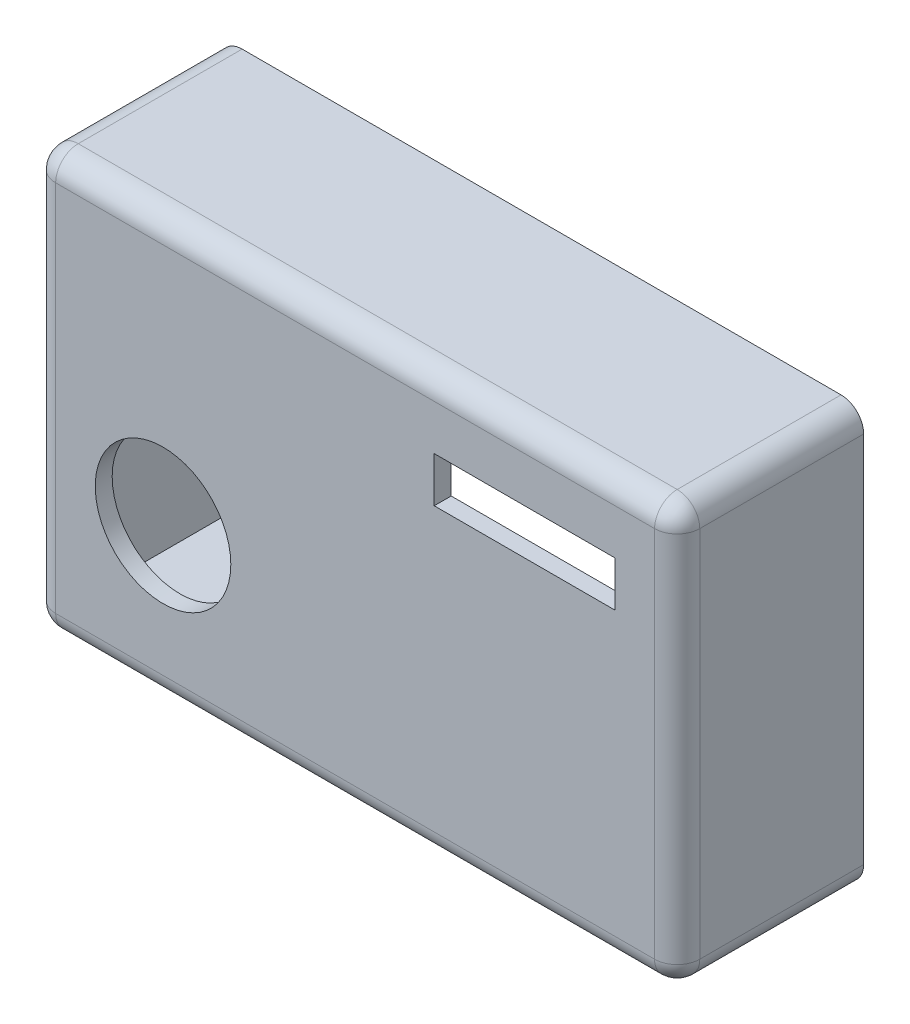
ISO-10303-21;
HEADER;
FILE_DESCRIPTION(('STEP AP214'),'2;1');
FILE_NAME('part.step','',(''),(''),'','','');
FILE_SCHEMA(('AUTOMOTIVE_DESIGN { 1 0 10303 214 1 1 1 1 }'));
ENDSEC;
DATA;
#1=APPLICATION_CONTEXT('core data for automotive mechanical design processes');
#2=APPLICATION_PROTOCOL_DEFINITION('international standard','automotive_design',2000,#1);
#3=PRODUCT_CONTEXT('',#1,'mechanical');
#4=PRODUCT('Part','Part','',(#3));
#5=PRODUCT_RELATED_PRODUCT_CATEGORY('part','',(#4));
#6=PRODUCT_DEFINITION_FORMATION('','',#4);
#7=PRODUCT_DEFINITION_CONTEXT('part definition',#1,'design');
#8=PRODUCT_DEFINITION('design','',#6,#7);
#9=PRODUCT_DEFINITION_SHAPE('','',#8);
#10=(LENGTH_UNIT() NAMED_UNIT(*) SI_UNIT(.MILLI.,.METRE.));
#11=(NAMED_UNIT(*) PLANE_ANGLE_UNIT() SI_UNIT($,.RADIAN.));
#12=(NAMED_UNIT(*) SI_UNIT($,.STERADIAN.) SOLID_ANGLE_UNIT());
#13=UNCERTAINTY_MEASURE_WITH_UNIT(LENGTH_MEASURE(1.E-05),#10,'distance_accuracy_value','');
#14=(GEOMETRIC_REPRESENTATION_CONTEXT(3) GLOBAL_UNCERTAINTY_ASSIGNED_CONTEXT((#13)) GLOBAL_UNIT_ASSIGNED_CONTEXT((#10,
#11,#12)) REPRESENTATION_CONTEXT('',''));
#15=CARTESIAN_POINT('',(0.,0.,0.));
#16=DIRECTION('',(0.,0.,1.));
#17=DIRECTION('',(1.,0.,0.));
#18=AXIS2_PLACEMENT_3D('',#15,#16,#17);
#19=CARTESIAN_POINT('',(0.,0.,1.5));
#20=DIRECTION('',(0.,0.,-1.));
#21=DIRECTION('',(-1.,0.,0.));
#22=AXIS2_PLACEMENT_3D('',#19,#20,#21);
#23=PLANE('',#22);
#24=DIRECTION('',(1.,0.,0.));
#25=VECTOR('',#24,1.);
#26=CARTESIAN_POINT('',(-28.5,16.5,1.5));
#27=LINE('',#26,#25);
#28=CARTESIAN_POINT('',(26.5,16.5,1.5));
#29=VERTEX_POINT('',#28);
#30=CARTESIAN_POINT('',(-26.5,16.5,1.5));
#31=VERTEX_POINT('',#30);
#32=EDGE_CURVE('E257',#29,#31,#27,.F.);
#33=ORIENTED_EDGE('',*,*,#32,.T.);
#34=DIRECTION('',(0.,1.,0.));
#35=VECTOR('',#34,1.);
#36=CARTESIAN_POINT('',(-26.5,-18.5,1.5));
#37=LINE('',#36,#35);
#38=CARTESIAN_POINT('',(-26.5,-16.5,1.5));
#39=VERTEX_POINT('',#38);
#40=EDGE_CURVE('E261',#31,#39,#37,.F.);
#41=ORIENTED_EDGE('',*,*,#40,.T.);
#42=DIRECTION('',(-1.,0.,0.));
#43=VECTOR('',#42,1.);
#44=CARTESIAN_POINT('',(28.5,-16.5,1.5));
#45=LINE('',#44,#43);
#46=CARTESIAN_POINT('',(26.5,-16.5,1.5));
#47=VERTEX_POINT('',#46);
#48=EDGE_CURVE('E259',#39,#47,#45,.F.);
#49=ORIENTED_EDGE('',*,*,#48,.T.);
#50=DIRECTION('',(0.,-1.,0.));
#51=VECTOR('',#50,1.);
#52=CARTESIAN_POINT('',(26.5,18.5,1.5));
#53=LINE('',#52,#51);
#54=EDGE_CURVE('E255',#47,#29,#53,.F.);
#55=ORIENTED_EDGE('',*,*,#54,.T.);
#56=EDGE_LOOP('',(#33,#41,#49,#55));
#57=FACE_BOUND('',#56,.T.);
#58=DIRECTION('',(-1.,0.,0.));
#59=VECTOR('',#58,1.);
#60=CARTESIAN_POINT('',(23.,12.5,1.5));
#61=LINE('',#60,#59);
#62=CARTESIAN_POINT('',(23.,12.5,1.5));
#63=VERTEX_POINT('',#62);
#64=CARTESIAN_POINT('',(7.,12.5,1.5));
#65=VERTEX_POINT('',#64);
#66=EDGE_CURVE('E207',#63,#65,#61,.T.);
#67=ORIENTED_EDGE('',*,*,#66,.F.);
#68=DIRECTION('',(0.,1.,0.));
#69=VECTOR('',#68,1.);
#70=CARTESIAN_POINT('',(23.,12.5,1.5));
#71=LINE('',#70,#69);
#72=CARTESIAN_POINT('',(23.,8.5,1.5));
#73=VERTEX_POINT('',#72);
#74=EDGE_CURVE('E205',#73,#63,#71,.T.);
#75=ORIENTED_EDGE('',*,*,#74,.F.);
#76=DIRECTION('',(1.,0.,0.));
#77=VECTOR('',#76,1.);
#78=CARTESIAN_POINT('',(23.,8.5,1.5));
#79=LINE('',#78,#77);
#80=CARTESIAN_POINT('',(7.,8.5,1.5));
#81=VERTEX_POINT('',#80);
#82=EDGE_CURVE('E213',#81,#73,#79,.T.);
#83=ORIENTED_EDGE('',*,*,#82,.F.);
#84=DIRECTION('',(0.,-1.,0.));
#85=VECTOR('',#84,1.);
#86=CARTESIAN_POINT('',(7.,12.5,1.5));
#87=LINE('',#86,#85);
#88=EDGE_CURVE('E210',#65,#81,#87,.T.);
#89=ORIENTED_EDGE('',*,*,#88,.F.);
#90=EDGE_LOOP('',(#67,#75,#83,#89));
#91=FACE_BOUND('',#90,.T.);
#92=CARTESIAN_POINT('',(-17.,-5.,1.5));
#93=DIRECTION('',(0.,0.,1.));
#94=DIRECTION('',(1.,0.,0.));
#95=AXIS2_PLACEMENT_3D('',#92,#93,#94);
#96=CIRCLE('',#95,6.);
#97=CARTESIAN_POINT('',(-11.,-5.,1.5));
#98=VERTEX_POINT('',#97);
#99=EDGE_CURVE('E201',#98,#98,#96,.T.);
#100=ORIENTED_EDGE('',*,*,#99,.F.);
#101=EDGE_LOOP('',(#100));
#102=FACE_BOUND('',#101,.T.);
#103=ADVANCED_FACE('F33',(#57,#91,#102),#23,.F.);
#104=CARTESIAN_POINT('',(0.,0.,0.));
#105=DIRECTION('',(0.,0.,-1.));
#106=DIRECTION('',(-1.,0.,0.));
#107=AXIS2_PLACEMENT_3D('',#104,#105,#106);
#108=PLANE('',#107);
#109=DIRECTION('',(0.,-1.,0.));
#110=VECTOR('',#109,1.);
#111=CARTESIAN_POINT('',(23.,0.,0.));
#112=LINE('',#111,#110);
#113=CARTESIAN_POINT('',(23.,12.5,0.));
#114=VERTEX_POINT('',#113);
#115=CARTESIAN_POINT('',(23.,8.5,0.));
#116=VERTEX_POINT('',#115);
#117=EDGE_CURVE('E246',#114,#116,#112,.T.);
#118=ORIENTED_EDGE('',*,*,#117,.F.);
#119=DIRECTION('',(1.,0.,0.));
#120=VECTOR('',#119,1.);
#121=CARTESIAN_POINT('',(0.,12.5,0.));
#122=LINE('',#121,#120);
#123=CARTESIAN_POINT('',(7.,12.5,0.));
#124=VERTEX_POINT('',#123);
#125=EDGE_CURVE('E237',#124,#114,#122,.T.);
#126=ORIENTED_EDGE('',*,*,#125,.F.);
#127=DIRECTION('',(0.,1.,0.));
#128=VECTOR('',#127,1.);
#129=CARTESIAN_POINT('',(7.,0.,0.));
#130=LINE('',#129,#128);
#131=CARTESIAN_POINT('',(7.,8.5,0.));
#132=VERTEX_POINT('',#131);
#133=EDGE_CURVE('E241',#132,#124,#130,.T.);
#134=ORIENTED_EDGE('',*,*,#133,.F.);
#135=DIRECTION('',(-1.,0.,0.));
#136=VECTOR('',#135,1.);
#137=CARTESIAN_POINT('',(0.,8.5,0.));
#138=LINE('',#137,#136);
#139=EDGE_CURVE('E244',#116,#132,#138,.T.);
#140=ORIENTED_EDGE('',*,*,#139,.F.);
#141=EDGE_LOOP('',(#118,#126,#134,#140));
#142=FACE_BOUND('',#141,.T.);
#143=CARTESIAN_POINT('',(-17.,-5.,0.));
#144=DIRECTION('',(0.,0.,-1.));
#145=DIRECTION('',(-1.,0.,0.));
#146=AXIS2_PLACEMENT_3D('',#143,#144,#145);
#147=CIRCLE('',#146,6.);
#148=CARTESIAN_POINT('',(-23.,-5.,0.));
#149=VERTEX_POINT('',#148);
#150=EDGE_CURVE('E219',#149,#149,#147,.T.);
#151=ORIENTED_EDGE('',*,*,#150,.F.);
#152=EDGE_LOOP('',(#151));
#153=FACE_BOUND('',#152,.T.);
#154=DIRECTION('',(0.,1.,0.));
#155=VECTOR('',#154,1.);
#156=CARTESIAN_POINT('',(27.,-17.,0.));
#157=LINE('',#156,#155);
#158=CARTESIAN_POINT('',(27.,-17.,0.));
#159=VERTEX_POINT('',#158);
#160=CARTESIAN_POINT('',(27.,17.,0.));
#161=VERTEX_POINT('',#160);
#162=EDGE_CURVE('E166',#159,#161,#157,.T.);
#163=ORIENTED_EDGE('',*,*,#162,.F.);
#164=DIRECTION('',(1.,0.,0.));
#165=VECTOR('',#164,1.);
#166=CARTESIAN_POINT('',(7.5,-17.,0.));
#167=LINE('',#166,#165);
#168=CARTESIAN_POINT('',(-27.,-17.,0.));
#169=VERTEX_POINT('',#168);
#170=EDGE_CURVE('E234',#169,#159,#167,.T.);
#171=ORIENTED_EDGE('',*,*,#170,.F.);
#172=DIRECTION('',(0.,-1.,0.));
#173=VECTOR('',#172,1.);
#174=CARTESIAN_POINT('',(-27.,-17.,0.));
#175=LINE('',#174,#173);
#176=CARTESIAN_POINT('',(-27.,17.,0.));
#177=VERTEX_POINT('',#176);
#178=EDGE_CURVE('E231',#177,#169,#175,.T.);
#179=ORIENTED_EDGE('',*,*,#178,.F.);
#180=DIRECTION('',(-1.,0.,0.));
#181=VECTOR('',#180,1.);
#182=CARTESIAN_POINT('',(-27.,17.,0.));
#183=LINE('',#182,#181);
#184=EDGE_CURVE('E229',#161,#177,#183,.T.);
#185=ORIENTED_EDGE('',*,*,#184,.F.);
#186=EDGE_LOOP('',(#163,#171,#179,#185));
#187=FACE_BOUND('',#186,.T.);
#188=ADVANCED_FACE('F378',(#142,#153,#187),#108,.T.);
#189=CARTESIAN_POINT('',(-17.,-5.,-0.5));
#190=DIRECTION('',(0.,0.,1.));
#191=DIRECTION('',(1.,0.,0.));
#192=AXIS2_PLACEMENT_3D('',#189,#190,#191);
#193=CYLINDRICAL_SURFACE('',#192,6.);
#194=ORIENTED_EDGE('',*,*,#150,.T.);
#195=EDGE_LOOP('',(#194));
#196=FACE_BOUND('',#195,.T.);
#197=ORIENTED_EDGE('',*,*,#99,.T.);
#198=EDGE_LOOP('',(#197));
#199=FACE_BOUND('',#198,.T.);
#200=ADVANCED_FACE('F383',(#196,#199),#193,.F.);
#201=CARTESIAN_POINT('',(23.,12.5,-0.5));
#202=DIRECTION('',(1.,0.,0.));
#203=DIRECTION('',(0.,0.,-1.));
#204=AXIS2_PLACEMENT_3D('',#201,#202,#203);
#205=PLANE('',#204);
#206=ORIENTED_EDGE('',*,*,#117,.T.);
#207=DIRECTION('',(0.,0.,1.));
#208=VECTOR('',#207,1.);
#209=CARTESIAN_POINT('',(23.,8.5,-0.5));
#210=LINE('',#209,#208);
#211=EDGE_CURVE('E217',#116,#73,#210,.T.);
#212=ORIENTED_EDGE('',*,*,#211,.T.);
#213=ORIENTED_EDGE('',*,*,#74,.T.);
#214=DIRECTION('',(0.,0.,1.));
#215=VECTOR('',#214,1.);
#216=CARTESIAN_POINT('',(23.,12.5,-0.5));
#217=LINE('',#216,#215);
#218=EDGE_CURVE('E216',#114,#63,#217,.T.);
#219=ORIENTED_EDGE('',*,*,#218,.F.);
#220=EDGE_LOOP('',(#206,#212,#213,#219));
#221=FACE_BOUND('',#220,.T.);
#222=ADVANCED_FACE('F600',(#221),#205,.F.);
#223=CARTESIAN_POINT('',(23.,8.5,-0.5));
#224=DIRECTION('',(0.,-1.,0.));
#225=DIRECTION('',(1.,0.,0.));
#226=AXIS2_PLACEMENT_3D('',#223,#224,#225);
#227=PLANE('',#226);
#228=ORIENTED_EDGE('',*,*,#139,.T.);
#229=DIRECTION('',(0.,0.,1.));
#230=VECTOR('',#229,1.);
#231=CARTESIAN_POINT('',(7.,8.5,-0.5));
#232=LINE('',#231,#230);
#233=EDGE_CURVE('E220',#132,#81,#232,.T.);
#234=ORIENTED_EDGE('',*,*,#233,.T.);
#235=ORIENTED_EDGE('',*,*,#82,.T.);
#236=ORIENTED_EDGE('',*,*,#211,.F.);
#237=EDGE_LOOP('',(#228,#234,#235,#236));
#238=FACE_BOUND('',#237,.T.);
#239=ADVANCED_FACE('F590',(#238),#227,.F.);
#240=CARTESIAN_POINT('',(7.,12.5,-0.5));
#241=DIRECTION('',(-1.,0.,0.));
#242=DIRECTION('',(0.,-1.,0.));
#243=AXIS2_PLACEMENT_3D('',#240,#241,#242);
#244=PLANE('',#243);
#245=ORIENTED_EDGE('',*,*,#133,.T.);
#246=DIRECTION('',(0.,0.,1.));
#247=VECTOR('',#246,1.);
#248=CARTESIAN_POINT('',(7.,12.5,-0.5));
#249=LINE('',#248,#247);
#250=EDGE_CURVE('E222',#124,#65,#249,.T.);
#251=ORIENTED_EDGE('',*,*,#250,.T.);
#252=ORIENTED_EDGE('',*,*,#88,.T.);
#253=ORIENTED_EDGE('',*,*,#233,.F.);
#254=EDGE_LOOP('',(#245,#251,#252,#253));
#255=FACE_BOUND('',#254,.T.);
#256=ADVANCED_FACE('F580',(#255),#244,.F.);
#257=CARTESIAN_POINT('',(23.,12.5,-0.5));
#258=DIRECTION('',(0.,1.,0.));
#259=DIRECTION('',(-1.,0.,0.));
#260=AXIS2_PLACEMENT_3D('',#257,#258,#259);
#261=PLANE('',#260);
#262=ORIENTED_EDGE('',*,*,#125,.T.);
#263=ORIENTED_EDGE('',*,*,#218,.T.);
#264=ORIENTED_EDGE('',*,*,#66,.T.);
#265=ORIENTED_EDGE('',*,*,#250,.F.);
#266=EDGE_LOOP('',(#262,#263,#264,#265));
#267=FACE_BOUND('',#266,.T.);
#268=ADVANCED_FACE('F524',(#267),#261,.F.);
#269=CARTESIAN_POINT('',(28.5,18.5,1.5));
#270=DIRECTION('',(1.,0.,0.));
#271=DIRECTION('',(0.,1.,0.));
#272=AXIS2_PLACEMENT_3D('',#269,#270,#271);
#273=PLANE('',#272);
#274=DIRECTION('',(0.,-1.,0.));
#275=VECTOR('',#274,1.);
#276=CARTESIAN_POINT('',(28.5,18.5,-15.));
#277=LINE('',#276,#275);
#278=CARTESIAN_POINT('',(28.5,16.5,-15.));
#279=VERTEX_POINT('',#278);
#280=CARTESIAN_POINT('',(28.5,-16.5,-15.));
#281=VERTEX_POINT('',#280);
#282=EDGE_CURVE('E189',#279,#281,#277,.T.);
#283=ORIENTED_EDGE('',*,*,#282,.F.);
#284=DIRECTION('',(0.,0.,-1.));
#285=VECTOR('',#284,1.);
#286=CARTESIAN_POINT('',(28.5,16.5,1.5));
#287=LINE('',#286,#285);
#288=CARTESIAN_POINT('',(28.5,16.5,-0.5));
#289=VERTEX_POINT('',#288);
#290=EDGE_CURVE('E50',#279,#289,#287,.F.);
#291=ORIENTED_EDGE('',*,*,#290,.T.);
#292=DIRECTION('',(0.,-1.,0.));
#293=VECTOR('',#292,1.);
#294=CARTESIAN_POINT('',(28.5,-18.5,-0.5));
#295=LINE('',#294,#293);
#296=CARTESIAN_POINT('',(28.5,-16.5,-0.5));
#297=VERTEX_POINT('',#296);
#298=EDGE_CURVE('E54',#289,#297,#295,.T.);
#299=ORIENTED_EDGE('',*,*,#298,.T.);
#300=DIRECTION('',(0.,0.,-1.));
#301=VECTOR('',#300,1.);
#302=CARTESIAN_POINT('',(28.5,-16.5,1.5));
#303=LINE('',#302,#301);
#304=EDGE_CURVE('E276',#297,#281,#303,.T.);
#305=ORIENTED_EDGE('',*,*,#304,.T.);
#306=EDGE_LOOP('',(#283,#291,#299,#305));
#307=FACE_BOUND('',#306,.T.);
#308=ADVANCED_FACE('F516',(#307),#273,.T.);
#309=CARTESIAN_POINT('',(28.5,18.5,1.5));
#310=DIRECTION('',(0.,1.,0.));
#311=DIRECTION('',(-1.,0.,0.));
#312=AXIS2_PLACEMENT_3D('',#309,#310,#311);
#313=PLANE('',#312);
#314=DIRECTION('',(1.,0.,0.));
#315=VECTOR('',#314,1.);
#316=CARTESIAN_POINT('',(28.5,18.5,-0.5));
#317=LINE('',#316,#315);
#318=CARTESIAN_POINT('',(-26.5,18.5,-0.5));
#319=VERTEX_POINT('',#318);
#320=CARTESIAN_POINT('',(26.5,18.5,-0.5));
#321=VERTEX_POINT('',#320);
#322=EDGE_CURVE('E272',#319,#321,#317,.T.);
#323=ORIENTED_EDGE('',*,*,#322,.T.);
#324=DIRECTION('',(0.,0.,-1.));
#325=VECTOR('',#324,1.);
#326=CARTESIAN_POINT('',(26.5,18.5,1.5));
#327=LINE('',#326,#325);
#328=CARTESIAN_POINT('',(26.5,18.5,-15.));
#329=VERTEX_POINT('',#328);
#330=EDGE_CURVE('E274',#321,#329,#327,.T.);
#331=ORIENTED_EDGE('',*,*,#330,.T.);
#332=DIRECTION('',(1.,0.,0.));
#333=VECTOR('',#332,1.);
#334=CARTESIAN_POINT('',(28.5,18.5,-15.));
#335=LINE('',#334,#333);
#336=CARTESIAN_POINT('',(-26.5,18.5,-15.));
#337=VERTEX_POINT('',#336);
#338=EDGE_CURVE('E170',#337,#329,#335,.T.);
#339=ORIENTED_EDGE('',*,*,#338,.F.);
#340=DIRECTION('',(0.,0.,-1.));
#341=VECTOR('',#340,1.);
#342=CARTESIAN_POINT('',(-26.5,18.5,1.5));
#343=LINE('',#342,#341);
#344=EDGE_CURVE('E270',#337,#319,#343,.F.);
#345=ORIENTED_EDGE('',*,*,#344,.T.);
#346=EDGE_LOOP('',(#323,#331,#339,#345));
#347=FACE_BOUND('',#346,.T.);
#348=ADVANCED_FACE('F352',(#347),#313,.T.);
#349=CARTESIAN_POINT('',(-28.5,18.5,1.5));
#350=DIRECTION('',(-1.,0.,0.));
#351=DIRECTION('',(0.,0.,1.));
#352=AXIS2_PLACEMENT_3D('',#349,#350,#351);
#353=PLANE('',#352);
#354=DIRECTION('',(0.,1.,0.));
#355=VECTOR('',#354,1.);
#356=CARTESIAN_POINT('',(-28.5,18.5,-15.));
#357=LINE('',#356,#355);
#358=CARTESIAN_POINT('',(-28.5,-16.5,-15.));
#359=VERTEX_POINT('',#358);
#360=CARTESIAN_POINT('',(-28.5,16.5,-15.));
#361=VERTEX_POINT('',#360);
#362=EDGE_CURVE('E195',#359,#361,#357,.T.);
#363=ORIENTED_EDGE('',*,*,#362,.F.);
#364=DIRECTION('',(0.,0.,-1.));
#365=VECTOR('',#364,1.);
#366=CARTESIAN_POINT('',(-28.5,-16.5,1.5));
#367=LINE('',#366,#365);
#368=CARTESIAN_POINT('',(-28.5,-16.5,-0.5));
#369=VERTEX_POINT('',#368);
#370=EDGE_CURVE('E253',#359,#369,#367,.F.);
#371=ORIENTED_EDGE('',*,*,#370,.T.);
#372=DIRECTION('',(0.,1.,0.));
#373=VECTOR('',#372,1.);
#374=CARTESIAN_POINT('',(-28.5,18.5,-0.5));
#375=LINE('',#374,#373);
#376=CARTESIAN_POINT('',(-28.5,16.5,-0.5));
#377=VERTEX_POINT('',#376);
#378=EDGE_CURVE('E250',#369,#377,#375,.T.);
#379=ORIENTED_EDGE('',*,*,#378,.T.);
#380=DIRECTION('',(0.,0.,-1.));
#381=VECTOR('',#380,1.);
#382=CARTESIAN_POINT('',(-28.5,16.5,1.5));
#383=LINE('',#382,#381);
#384=EDGE_CURVE('E248',#377,#361,#383,.T.);
#385=ORIENTED_EDGE('',*,*,#384,.T.);
#386=EDGE_LOOP('',(#363,#371,#379,#385));
#387=FACE_BOUND('',#386,.T.);
#388=ADVANCED_FACE('F342',(#387),#353,.T.);
#389=CARTESIAN_POINT('',(28.5,-18.5,1.5));
#390=DIRECTION('',(0.,-1.,0.));
#391=DIRECTION('',(0.,0.,-1.));
#392=AXIS2_PLACEMENT_3D('',#389,#390,#391);
#393=PLANE('',#392);
#394=DIRECTION('',(-1.,0.,0.));
#395=VECTOR('',#394,1.);
#396=CARTESIAN_POINT('',(28.5,-18.5,-15.));
#397=LINE('',#396,#395);
#398=CARTESIAN_POINT('',(26.5,-18.5,-15.));
#399=VERTEX_POINT('',#398);
#400=CARTESIAN_POINT('',(-26.5,-18.5,-15.));
#401=VERTEX_POINT('',#400);
#402=EDGE_CURVE('E192',#399,#401,#397,.T.);
#403=ORIENTED_EDGE('',*,*,#402,.F.);
#404=DIRECTION('',(0.,0.,-1.));
#405=VECTOR('',#404,1.);
#406=CARTESIAN_POINT('',(26.5,-18.5,1.5));
#407=LINE('',#406,#405);
#408=CARTESIAN_POINT('',(26.5,-18.5,-0.5));
#409=VERTEX_POINT('',#408);
#410=EDGE_CURVE('E268',#399,#409,#407,.F.);
#411=ORIENTED_EDGE('',*,*,#410,.T.);
#412=DIRECTION('',(-1.,0.,0.));
#413=VECTOR('',#412,1.);
#414=CARTESIAN_POINT('',(-28.5,-18.5,-0.5));
#415=LINE('',#414,#413);
#416=CARTESIAN_POINT('',(-26.5,-18.5,-0.5));
#417=VERTEX_POINT('',#416);
#418=EDGE_CURVE('E266',#409,#417,#415,.T.);
#419=ORIENTED_EDGE('',*,*,#418,.T.);
#420=DIRECTION('',(0.,0.,-1.));
#421=VECTOR('',#420,1.);
#422=CARTESIAN_POINT('',(-26.5,-18.5,1.5));
#423=LINE('',#422,#421);
#424=EDGE_CURVE('E264',#417,#401,#423,.T.);
#425=ORIENTED_EDGE('',*,*,#424,.T.);
#426=EDGE_LOOP('',(#403,#411,#419,#425));
#427=FACE_BOUND('',#426,.T.);
#428=ADVANCED_FACE('F330',(#427),#393,.T.);
#429=CARTESIAN_POINT('',(-27.,17.,1.5));
#430=DIRECTION('',(0.,1.,0.));
#431=DIRECTION('',(0.,0.,1.));
#432=AXIS2_PLACEMENT_3D('',#429,#430,#431);
#433=PLANE('',#432);
#434=ORIENTED_EDGE('',*,*,#184,.T.);
#435=DIRECTION('',(0.,0.,-1.));
#436=VECTOR('',#435,1.);
#437=CARTESIAN_POINT('',(-27.,17.,1.5));
#438=LINE('',#437,#436);
#439=CARTESIAN_POINT('',(-27.,17.,-15.));
#440=VERTEX_POINT('',#439);
#441=EDGE_CURVE('E176',#177,#440,#438,.T.);
#442=ORIENTED_EDGE('',*,*,#441,.T.);
#443=DIRECTION('',(1.,0.,0.));
#444=VECTOR('',#443,1.);
#445=CARTESIAN_POINT('',(-27.,17.,-15.));
#446=LINE('',#445,#444);
#447=CARTESIAN_POINT('',(27.,17.,-15.));
#448=VERTEX_POINT('',#447);
#449=EDGE_CURVE('E173',#440,#448,#446,.T.);
#450=ORIENTED_EDGE('',*,*,#449,.T.);
#451=DIRECTION('',(0.,0.,-1.));
#452=VECTOR('',#451,1.);
#453=CARTESIAN_POINT('',(27.,17.,1.5));
#454=LINE('',#453,#452);
#455=EDGE_CURVE('E159',#161,#448,#454,.T.);
#456=ORIENTED_EDGE('',*,*,#455,.F.);
#457=EDGE_LOOP('',(#434,#442,#450,#456));
#458=FACE_BOUND('',#457,.T.);
#459=ADVANCED_FACE('F174',(#458),#433,.F.);
#460=CARTESIAN_POINT('',(-27.,-17.,1.5));
#461=DIRECTION('',(-1.,0.,0.));
#462=DIRECTION('',(0.,0.,1.));
#463=AXIS2_PLACEMENT_3D('',#460,#461,#462);
#464=PLANE('',#463);
#465=ORIENTED_EDGE('',*,*,#178,.T.);
#466=DIRECTION('',(0.,0.,-1.));
#467=VECTOR('',#466,1.);
#468=CARTESIAN_POINT('',(-27.,-17.,1.5));
#469=LINE('',#468,#467);
#470=CARTESIAN_POINT('',(-27.,-17.,-15.));
#471=VERTEX_POINT('',#470);
#472=EDGE_CURVE('E202',#169,#471,#469,.T.);
#473=ORIENTED_EDGE('',*,*,#472,.T.);
#474=DIRECTION('',(0.,1.,0.));
#475=VECTOR('',#474,1.);
#476=CARTESIAN_POINT('',(-27.,-17.,-15.));
#477=LINE('',#476,#475);
#478=EDGE_CURVE('E185',#471,#440,#477,.T.);
#479=ORIENTED_EDGE('',*,*,#478,.T.);
#480=ORIENTED_EDGE('',*,*,#441,.F.);
#481=EDGE_LOOP('',(#465,#473,#479,#480));
#482=FACE_BOUND('',#481,.T.);
#483=ADVANCED_FACE('F547',(#482),#464,.F.);
#484=CARTESIAN_POINT('',(27.,-17.,1.5));
#485=DIRECTION('',(0.,-1.,0.));
#486=DIRECTION('',(1.,0.,0.));
#487=AXIS2_PLACEMENT_3D('',#484,#485,#486);
#488=PLANE('',#487);
#489=ORIENTED_EDGE('',*,*,#170,.T.);
#490=DIRECTION('',(0.,0.,-1.));
#491=VECTOR('',#490,1.);
#492=CARTESIAN_POINT('',(27.,-17.,1.5));
#493=LINE('',#492,#491);
#494=CARTESIAN_POINT('',(27.,-17.,-15.));
#495=VERTEX_POINT('',#494);
#496=EDGE_CURVE('E169',#159,#495,#493,.T.);
#497=ORIENTED_EDGE('',*,*,#496,.T.);
#498=DIRECTION('',(-1.,0.,0.));
#499=VECTOR('',#498,1.);
#500=CARTESIAN_POINT('',(27.,-17.,-15.));
#501=LINE('',#500,#499);
#502=EDGE_CURVE('E183',#495,#471,#501,.T.);
#503=ORIENTED_EDGE('',*,*,#502,.T.);
#504=ORIENTED_EDGE('',*,*,#472,.F.);
#505=EDGE_LOOP('',(#489,#497,#503,#504));
#506=FACE_BOUND('',#505,.T.);
#507=ADVANCED_FACE('F538',(#506),#488,.F.);
#508=CARTESIAN_POINT('',(27.,17.,1.5));
#509=DIRECTION('',(1.,0.,0.));
#510=DIRECTION('',(0.,0.,-1.));
#511=AXIS2_PLACEMENT_3D('',#508,#509,#510);
#512=PLANE('',#511);
#513=ORIENTED_EDGE('',*,*,#162,.T.);
#514=ORIENTED_EDGE('',*,*,#455,.T.);
#515=DIRECTION('',(0.,-1.,0.));
#516=VECTOR('',#515,1.);
#517=CARTESIAN_POINT('',(27.,17.,-15.));
#518=LINE('',#517,#516);
#519=EDGE_CURVE('E164',#448,#495,#518,.T.);
#520=ORIENTED_EDGE('',*,*,#519,.T.);
#521=ORIENTED_EDGE('',*,*,#496,.F.);
#522=EDGE_LOOP('',(#513,#514,#520,#521));
#523=FACE_BOUND('',#522,.T.);
#524=ADVANCED_FACE('F161',(#523),#512,.F.);
#525=CARTESIAN_POINT('',(0.,0.,-15.));
#526=DIRECTION('',(0.,0.,-1.));
#527=DIRECTION('',(-1.,0.,0.));
#528=AXIS2_PLACEMENT_3D('',#525,#526,#527);
#529=PLANE('',#528);
#530=ORIENTED_EDGE('',*,*,#338,.T.);
#531=CARTESIAN_POINT('',(26.5,16.5,-15.));
#532=DIRECTION('',(0.,0.,-1.));
#533=DIRECTION('',(-1.,0.,0.));
#534=AXIS2_PLACEMENT_3D('',#531,#532,#533);
#535=CIRCLE('',#534,2.);
#536=EDGE_CURVE('E11',#329,#279,#535,.T.);
#537=ORIENTED_EDGE('',*,*,#536,.T.);
#538=ORIENTED_EDGE('',*,*,#282,.T.);
#539=CARTESIAN_POINT('',(26.5,-16.5,-15.));
#540=DIRECTION('',(0.,0.,-1.));
#541=DIRECTION('',(-1.,0.,0.));
#542=AXIS2_PLACEMENT_3D('',#539,#540,#541);
#543=CIRCLE('',#542,2.);
#544=EDGE_CURVE('E42',#281,#399,#543,.T.);
#545=ORIENTED_EDGE('',*,*,#544,.T.);
#546=ORIENTED_EDGE('',*,*,#402,.T.);
#547=CARTESIAN_POINT('',(-26.5,-16.5,-15.));
#548=DIRECTION('',(0.,0.,-1.));
#549=DIRECTION('',(-1.,0.,0.));
#550=AXIS2_PLACEMENT_3D('',#547,#548,#549);
#551=CIRCLE('',#550,2.);
#552=EDGE_CURVE('E282',#401,#359,#551,.T.);
#553=ORIENTED_EDGE('',*,*,#552,.T.);
#554=ORIENTED_EDGE('',*,*,#362,.T.);
#555=CARTESIAN_POINT('',(-26.5,16.5,-15.));
#556=DIRECTION('',(0.,0.,-1.));
#557=DIRECTION('',(-1.,0.,0.));
#558=AXIS2_PLACEMENT_3D('',#555,#556,#557);
#559=CIRCLE('',#558,2.);
#560=EDGE_CURVE('E280',#361,#337,#559,.T.);
#561=ORIENTED_EDGE('',*,*,#560,.T.);
#562=EDGE_LOOP('',(#530,#537,#538,#545,#546,#553,#554,#561));
#563=FACE_BOUND('',#562,.T.);
#564=ORIENTED_EDGE('',*,*,#519,.F.);
#565=ORIENTED_EDGE('',*,*,#449,.F.);
#566=ORIENTED_EDGE('',*,*,#478,.F.);
#567=ORIENTED_EDGE('',*,*,#502,.F.);
#568=EDGE_LOOP('',(#564,#565,#566,#567));
#569=FACE_BOUND('',#568,.T.);
#570=ADVANCED_FACE('F181',(#563,#569),#529,.T.);
#571=CARTESIAN_POINT('',(26.5,-16.5,1.5));
#572=DIRECTION('',(0.,0.,-1.));
#573=DIRECTION('',(-1.,0.,0.));
#574=AXIS2_PLACEMENT_3D('',#571,#572,#573);
#575=CYLINDRICAL_SURFACE('',#574,2.);
#576=ORIENTED_EDGE('',*,*,#544,.F.);
#577=ORIENTED_EDGE('',*,*,#304,.F.);
#578=CARTESIAN_POINT('',(26.5,-16.5,-0.5));
#579=DIRECTION('',(0.,0.,1.));
#580=DIRECTION('',(1.,0.,0.));
#581=AXIS2_PLACEMENT_3D('',#578,#579,#580);
#582=CIRCLE('',#581,2.);
#583=EDGE_CURVE('E312',#409,#297,#582,.T.);
#584=ORIENTED_EDGE('',*,*,#583,.F.);
#585=ORIENTED_EDGE('',*,*,#410,.F.);
#586=EDGE_LOOP('',(#576,#577,#584,#585));
#587=FACE_BOUND('',#586,.T.);
#588=ADVANCED_FACE('F35',(#587),#575,.T.);
#589=CARTESIAN_POINT('',(26.5,16.5,1.5));
#590=DIRECTION('',(0.,0.,-1.));
#591=DIRECTION('',(-1.,0.,0.));
#592=AXIS2_PLACEMENT_3D('',#589,#590,#591);
#593=CYLINDRICAL_SURFACE('',#592,2.);
#594=ORIENTED_EDGE('',*,*,#536,.F.);
#595=ORIENTED_EDGE('',*,*,#330,.F.);
#596=CARTESIAN_POINT('',(26.5,16.5,-0.5));
#597=DIRECTION('',(0.,0.,1.));
#598=DIRECTION('',(1.,0.,0.));
#599=AXIS2_PLACEMENT_3D('',#596,#597,#598);
#600=CIRCLE('',#599,2.);
#601=EDGE_CURVE('E310',#289,#321,#600,.T.);
#602=ORIENTED_EDGE('',*,*,#601,.F.);
#603=ORIENTED_EDGE('',*,*,#290,.F.);
#604=EDGE_LOOP('',(#594,#595,#602,#603));
#605=FACE_BOUND('',#604,.T.);
#606=ADVANCED_FACE('F357',(#605),#593,.T.);
#607=CARTESIAN_POINT('',(26.5,18.5,-0.5));
#608=DIRECTION('',(0.,1.,0.));
#609=DIRECTION('',(-1.,0.,0.));
#610=AXIS2_PLACEMENT_3D('',#607,#608,#609);
#611=CYLINDRICAL_SURFACE('',#610,2.);
#612=CARTESIAN_POINT('',(26.5,-16.5,-0.5));
#613=DIRECTION('',(0.,-1.,0.));
#614=DIRECTION('',(0.,0.,-1.));
#615=AXIS2_PLACEMENT_3D('',#612,#613,#614);
#616=CIRCLE('',#615,2.);
#617=EDGE_CURVE('E37',#297,#47,#616,.T.);
#618=ORIENTED_EDGE('',*,*,#617,.F.);
#619=ORIENTED_EDGE('',*,*,#298,.F.);
#620=CARTESIAN_POINT('',(26.5,16.5,-0.5));
#621=DIRECTION('',(0.,1.,0.));
#622=DIRECTION('',(0.,0.,1.));
#623=AXIS2_PLACEMENT_3D('',#620,#621,#622);
#624=CIRCLE('',#623,2.);
#625=EDGE_CURVE('E307',#29,#289,#624,.T.);
#626=ORIENTED_EDGE('',*,*,#625,.F.);
#627=ORIENTED_EDGE('',*,*,#54,.F.);
#628=EDGE_LOOP('',(#618,#619,#626,#627));
#629=FACE_BOUND('',#628,.T.);
#630=ADVANCED_FACE('F369',(#629),#611,.T.);
#631=CARTESIAN_POINT('',(26.5,-16.5,-0.5));
#632=DIRECTION('',(1.,0.,0.));
#633=DIRECTION('',(0.,1.,0.));
#634=AXIS2_PLACEMENT_3D('',#631,#632,#633);
#635=SPHERICAL_SURFACE('',#634,2.);
#636=ORIENTED_EDGE('',*,*,#583,.T.);
#637=ORIENTED_EDGE('',*,*,#617,.T.);
#638=CARTESIAN_POINT('',(26.5,-16.5,-0.5));
#639=DIRECTION('',(1.,0.,0.));
#640=DIRECTION('',(0.,0.,-1.));
#641=AXIS2_PLACEMENT_3D('',#638,#639,#640);
#642=CIRCLE('',#641,2.);
#643=EDGE_CURVE('E304',#409,#47,#642,.F.);
#644=ORIENTED_EDGE('',*,*,#643,.F.);
#645=EDGE_LOOP('',(#636,#637,#644));
#646=FACE_BOUND('',#645,.T.);
#647=ADVANCED_FACE('F319',(#646),#635,.T.);
#648=CARTESIAN_POINT('',(26.5,16.5,-0.5));
#649=DIRECTION('',(1.,0.,0.));
#650=DIRECTION('',(0.,0.,-1.));
#651=AXIS2_PLACEMENT_3D('',#648,#649,#650);
#652=SPHERICAL_SURFACE('',#651,2.);
#653=ORIENTED_EDGE('',*,*,#625,.T.);
#654=ORIENTED_EDGE('',*,*,#601,.T.);
#655=CARTESIAN_POINT('',(26.5,16.5,-0.5));
#656=DIRECTION('',(1.,0.,0.));
#657=DIRECTION('',(0.,0.,-1.));
#658=AXIS2_PLACEMENT_3D('',#655,#656,#657);
#659=CIRCLE('',#658,2.);
#660=EDGE_CURVE('E301',#29,#321,#659,.F.);
#661=ORIENTED_EDGE('',*,*,#660,.F.);
#662=EDGE_LOOP('',(#653,#654,#661));
#663=FACE_BOUND('',#662,.T.);
#664=ADVANCED_FACE('F360',(#663),#652,.T.);
#665=CARTESIAN_POINT('',(28.5,-16.5,-0.5));
#666=DIRECTION('',(1.,0.,0.));
#667=DIRECTION('',(0.,0.,-1.));
#668=AXIS2_PLACEMENT_3D('',#665,#666,#667);
#669=CYLINDRICAL_SURFACE('',#668,2.);
#670=ORIENTED_EDGE('',*,*,#643,.T.);
#671=ORIENTED_EDGE('',*,*,#48,.F.);
#672=CARTESIAN_POINT('',(-26.5,-16.5,-0.5));
#673=DIRECTION('',(-1.,0.,0.));
#674=DIRECTION('',(0.,0.,1.));
#675=AXIS2_PLACEMENT_3D('',#672,#673,#674);
#676=CIRCLE('',#675,2.);
#677=EDGE_CURVE('E298',#417,#39,#676,.T.);
#678=ORIENTED_EDGE('',*,*,#677,.F.);
#679=ORIENTED_EDGE('',*,*,#418,.F.);
#680=EDGE_LOOP('',(#670,#671,#678,#679));
#681=FACE_BOUND('',#680,.T.);
#682=ADVANCED_FACE('F325',(#681),#669,.T.);
#683=CARTESIAN_POINT('',(-26.5,-16.5,1.5));
#684=DIRECTION('',(0.,0.,-1.));
#685=DIRECTION('',(-1.,0.,0.));
#686=AXIS2_PLACEMENT_3D('',#683,#684,#685);
#687=CYLINDRICAL_SURFACE('',#686,2.);
#688=ORIENTED_EDGE('',*,*,#552,.F.);
#689=ORIENTED_EDGE('',*,*,#424,.F.);
#690=CARTESIAN_POINT('',(-26.5,-16.5,-0.5));
#691=DIRECTION('',(0.,0.,1.));
#692=DIRECTION('',(1.,0.,0.));
#693=AXIS2_PLACEMENT_3D('',#690,#691,#692);
#694=CIRCLE('',#693,2.);
#695=EDGE_CURVE('E295',#369,#417,#694,.T.);
#696=ORIENTED_EDGE('',*,*,#695,.F.);
#697=ORIENTED_EDGE('',*,*,#370,.F.);
#698=EDGE_LOOP('',(#688,#689,#696,#697));
#699=FACE_BOUND('',#698,.T.);
#700=ADVANCED_FACE('F335',(#699),#687,.T.);
#701=CARTESIAN_POINT('',(-26.5,16.5,1.5));
#702=DIRECTION('',(0.,0.,-1.));
#703=DIRECTION('',(-1.,0.,0.));
#704=AXIS2_PLACEMENT_3D('',#701,#702,#703);
#705=CYLINDRICAL_SURFACE('',#704,2.);
#706=ORIENTED_EDGE('',*,*,#560,.F.);
#707=ORIENTED_EDGE('',*,*,#384,.F.);
#708=CARTESIAN_POINT('',(-26.5,16.5,-0.5));
#709=DIRECTION('',(0.,0.,1.));
#710=DIRECTION('',(1.,0.,0.));
#711=AXIS2_PLACEMENT_3D('',#708,#709,#710);
#712=CIRCLE('',#711,2.);
#713=EDGE_CURVE('E292',#319,#377,#712,.T.);
#714=ORIENTED_EDGE('',*,*,#713,.F.);
#715=ORIENTED_EDGE('',*,*,#344,.F.);
#716=EDGE_LOOP('',(#706,#707,#714,#715));
#717=FACE_BOUND('',#716,.T.);
#718=ADVANCED_FACE('F347',(#717),#705,.T.);
#719=CARTESIAN_POINT('',(28.5,16.5,-0.5));
#720=DIRECTION('',(-1.,0.,0.));
#721=DIRECTION('',(0.,-1.,0.));
#722=AXIS2_PLACEMENT_3D('',#719,#720,#721);
#723=CYLINDRICAL_SURFACE('',#722,2.);
#724=ORIENTED_EDGE('',*,*,#660,.T.);
#725=ORIENTED_EDGE('',*,*,#322,.F.);
#726=CARTESIAN_POINT('',(-26.5,16.5,-0.5));
#727=DIRECTION('',(-1.,0.,0.));
#728=DIRECTION('',(0.,0.,1.));
#729=AXIS2_PLACEMENT_3D('',#726,#727,#728);
#730=CIRCLE('',#729,2.);
#731=EDGE_CURVE('E289',#31,#319,#730,.T.);
#732=ORIENTED_EDGE('',*,*,#731,.F.);
#733=ORIENTED_EDGE('',*,*,#32,.F.);
#734=EDGE_LOOP('',(#724,#725,#732,#733));
#735=FACE_BOUND('',#734,.T.);
#736=ADVANCED_FACE('F364',(#735),#723,.T.);
#737=CARTESIAN_POINT('',(-26.5,-16.5,-0.5));
#738=DIRECTION('',(0.,-1.,0.));
#739=DIRECTION('',(1.,0.,0.));
#740=AXIS2_PLACEMENT_3D('',#737,#738,#739);
#741=SPHERICAL_SURFACE('',#740,2.);
#742=ORIENTED_EDGE('',*,*,#695,.T.);
#743=ORIENTED_EDGE('',*,*,#677,.T.);
#744=CARTESIAN_POINT('',(-26.5,-16.5,-0.5));
#745=DIRECTION('',(0.,-1.,0.));
#746=DIRECTION('',(0.,0.,-1.));
#747=AXIS2_PLACEMENT_3D('',#744,#745,#746);
#748=CIRCLE('',#747,2.);
#749=EDGE_CURVE('E287',#369,#39,#748,.F.);
#750=ORIENTED_EDGE('',*,*,#749,.F.);
#751=EDGE_LOOP('',(#742,#743,#750));
#752=FACE_BOUND('',#751,.T.);
#753=ADVANCED_FACE('F396',(#752),#741,.T.);
#754=CARTESIAN_POINT('',(-26.5,16.5,-0.5));
#755=DIRECTION('',(0.,1.,0.));
#756=DIRECTION('',(0.,0.,1.));
#757=AXIS2_PLACEMENT_3D('',#754,#755,#756);
#758=SPHERICAL_SURFACE('',#757,2.);
#759=ORIENTED_EDGE('',*,*,#731,.T.);
#760=ORIENTED_EDGE('',*,*,#713,.T.);
#761=CARTESIAN_POINT('',(-26.5,16.5,-0.5));
#762=DIRECTION('',(0.,1.,0.));
#763=DIRECTION('',(0.,0.,1.));
#764=AXIS2_PLACEMENT_3D('',#761,#762,#763);
#765=CIRCLE('',#764,2.);
#766=EDGE_CURVE('E285',#31,#377,#765,.F.);
#767=ORIENTED_EDGE('',*,*,#766,.F.);
#768=EDGE_LOOP('',(#759,#760,#767));
#769=FACE_BOUND('',#768,.T.);
#770=ADVANCED_FACE('F392',(#769),#758,.T.);
#771=CARTESIAN_POINT('',(-26.5,18.5,-0.5));
#772=DIRECTION('',(0.,-1.,0.));
#773=DIRECTION('',(0.,0.,-1.));
#774=AXIS2_PLACEMENT_3D('',#771,#772,#773);
#775=CYLINDRICAL_SURFACE('',#774,2.);
#776=ORIENTED_EDGE('',*,*,#749,.T.);
#777=ORIENTED_EDGE('',*,*,#40,.F.);
#778=ORIENTED_EDGE('',*,*,#766,.T.);
#779=ORIENTED_EDGE('',*,*,#378,.F.);
#780=EDGE_LOOP('',(#776,#777,#778,#779));
#781=FACE_BOUND('',#780,.T.);
#782=ADVANCED_FACE('F389',(#781),#775,.T.);
#783=CLOSED_SHELL('',(#103,#188,#200,#222,#239,#256,#268,#308,#348,#388,#428,#459,#483,#507,
#524,#570,#588,#606,#630,#647,#664,#682,#700,#718,#736,#753,#770,#782));
#784=MANIFOLD_SOLID_BREP('B2',#783);
#785=ADVANCED_BREP_SHAPE_REPRESENTATION('',(#18,#784),#14);
#786=SHAPE_DEFINITION_REPRESENTATION(#9,#785);
ENDSEC;
END-ISO-10303-21;
